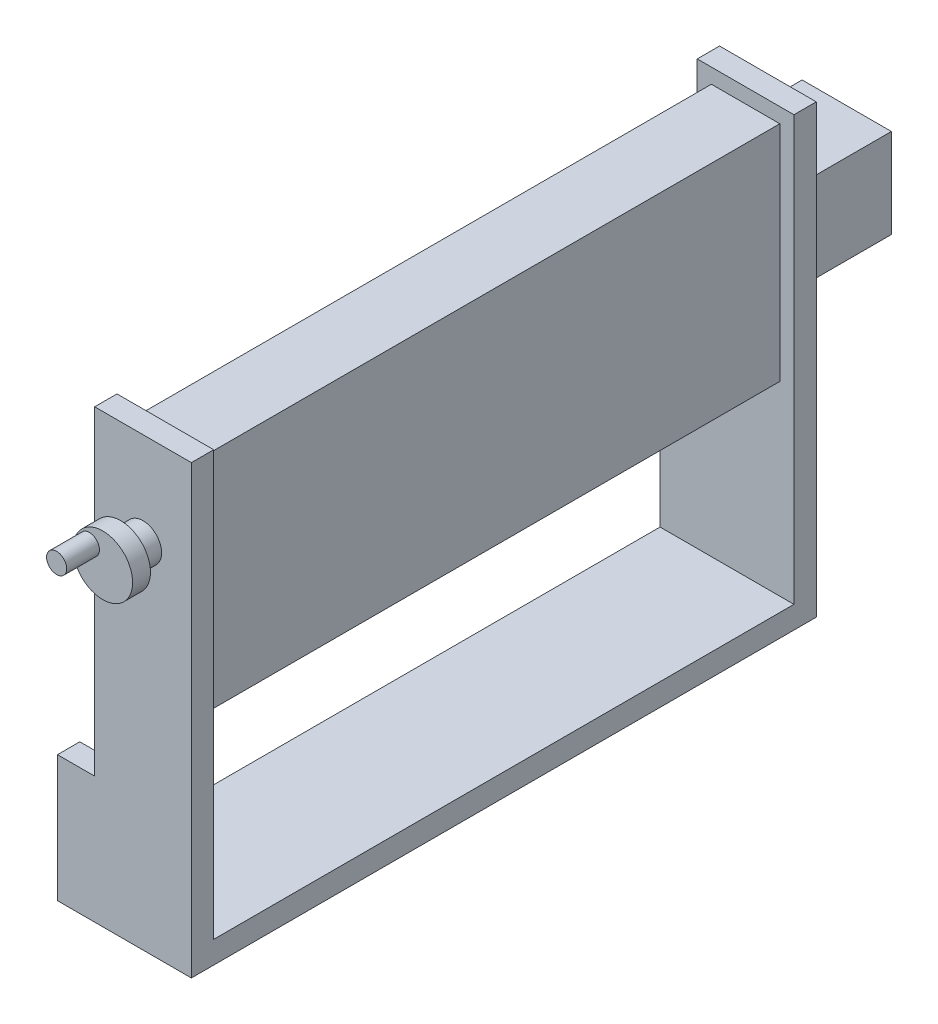
ISO-10303-21;
HEADER;
FILE_DESCRIPTION(('STEP AP214'),'2;1');
FILE_NAME('part.step','',(''),(''),'','','');
FILE_SCHEMA(('AUTOMOTIVE_DESIGN { 1 0 10303 214 1 1 1 1 }'));
ENDSEC;
DATA;
#1=APPLICATION_CONTEXT('core data for automotive mechanical design processes');
#2=APPLICATION_PROTOCOL_DEFINITION('international standard','automotive_design',2000,#1);
#3=PRODUCT_CONTEXT('',#1,'mechanical');
#4=PRODUCT('Part','Part','',(#3));
#5=PRODUCT_RELATED_PRODUCT_CATEGORY('part','',(#4));
#6=PRODUCT_DEFINITION_FORMATION('','',#4);
#7=PRODUCT_DEFINITION_CONTEXT('part definition',#1,'design');
#8=PRODUCT_DEFINITION('design','',#6,#7);
#9=PRODUCT_DEFINITION_SHAPE('','',#8);
#10=(LENGTH_UNIT() NAMED_UNIT(*) SI_UNIT(.MILLI.,.METRE.));
#11=(NAMED_UNIT(*) PLANE_ANGLE_UNIT() SI_UNIT($,.RADIAN.));
#12=(NAMED_UNIT(*) SI_UNIT($,.STERADIAN.) SOLID_ANGLE_UNIT());
#13=UNCERTAINTY_MEASURE_WITH_UNIT(LENGTH_MEASURE(1.E-05),#10,'distance_accuracy_value','');
#14=(GEOMETRIC_REPRESENTATION_CONTEXT(3) GLOBAL_UNCERTAINTY_ASSIGNED_CONTEXT((#13)) GLOBAL_UNIT_ASSIGNED_CONTEXT((#10,
#11,#12)) REPRESENTATION_CONTEXT('',''));
#15=CARTESIAN_POINT('',(0.,0.,0.));
#16=DIRECTION('',(0.,0.,1.));
#17=DIRECTION('',(1.,0.,0.));
#18=AXIS2_PLACEMENT_3D('',#15,#16,#17);
#19=CARTESIAN_POINT('',(0.,0.,0.));
#20=DIRECTION('',(0.,0.,-1.));
#21=DIRECTION('',(-1.,0.,0.));
#22=AXIS2_PLACEMENT_3D('',#19,#20,#21);
#23=PLANE('',#22);
#24=DIRECTION('',(-1.,0.,0.));
#25=VECTOR('',#24,1.);
#26=CARTESIAN_POINT('',(80.5,140.,0.));
#27=LINE('',#26,#25);
#28=CARTESIAN_POINT('',(80.5,140.,0.));
#29=VERTEX_POINT('',#28);
#30=CARTESIAN_POINT('',(34.5,140.,0.));
#31=VERTEX_POINT('',#30);
#32=EDGE_CURVE('E235',#29,#31,#27,.T.);
#33=ORIENTED_EDGE('',*,*,#32,.F.);
#34=DIRECTION('',(0.,-1.,0.));
#35=VECTOR('',#34,1.);
#36=CARTESIAN_POINT('',(80.5,290.,0.));
#37=LINE('',#36,#35);
#38=CARTESIAN_POINT('',(80.5,290.,0.));
#39=VERTEX_POINT('',#38);
#40=EDGE_CURVE('E218',#39,#29,#37,.T.);
#41=ORIENTED_EDGE('',*,*,#40,.F.);
#42=DIRECTION('',(1.,0.,0.));
#43=VECTOR('',#42,1.);
#44=CARTESIAN_POINT('',(80.5,290.,0.));
#45=LINE('',#44,#43);
#46=CARTESIAN_POINT('',(34.5,290.,0.));
#47=VERTEX_POINT('',#46);
#48=EDGE_CURVE('E223',#47,#39,#45,.T.);
#49=ORIENTED_EDGE('',*,*,#48,.F.);
#50=DIRECTION('',(0.,1.,0.));
#51=VECTOR('',#50,1.);
#52=CARTESIAN_POINT('',(34.5,290.,0.));
#53=LINE('',#52,#51);
#54=EDGE_CURVE('E237',#31,#47,#53,.T.);
#55=ORIENTED_EDGE('',*,*,#54,.F.);
#56=EDGE_LOOP('',(#33,#41,#49,#55));
#57=FACE_BOUND('',#56,.T.);
#58=DIRECTION('',(0.,1.,0.));
#59=VECTOR('',#58,1.);
#60=CARTESIAN_POINT('',(90.,0.,0.));
#61=LINE('',#60,#59);
#62=CARTESIAN_POINT('',(90.,15.,0.));
#63=VERTEX_POINT('',#62);
#64=CARTESIAN_POINT('',(90.,300.,0.));
#65=VERTEX_POINT('',#64);
#66=EDGE_CURVE('E277',#63,#65,#61,.T.);
#67=ORIENTED_EDGE('',*,*,#66,.F.);
#68=DIRECTION('',(1.,0.,0.));
#69=VECTOR('',#68,1.);
#70=CARTESIAN_POINT('',(0.,15.,0.));
#71=LINE('',#70,#69);
#72=CARTESIAN_POINT('',(0.,15.,0.));
#73=VERTEX_POINT('',#72);
#74=EDGE_CURVE('E173',#73,#63,#71,.T.);
#75=ORIENTED_EDGE('',*,*,#74,.F.);
#76=DIRECTION('',(0.,-1.,0.));
#77=VECTOR('',#76,1.);
#78=CARTESIAN_POINT('',(0.,0.,0.));
#79=LINE('',#78,#77);
#80=CARTESIAN_POINT('',(0.,85.,0.));
#81=VERTEX_POINT('',#80);
#82=EDGE_CURVE('E259',#81,#73,#79,.T.);
#83=ORIENTED_EDGE('',*,*,#82,.F.);
#84=DIRECTION('',(-1.,0.,0.));
#85=VECTOR('',#84,1.);
#86=CARTESIAN_POINT('',(0.,85.,0.));
#87=LINE('',#86,#85);
#88=CARTESIAN_POINT('',(25.,85.,0.));
#89=VERTEX_POINT('',#88);
#90=EDGE_CURVE('E264',#89,#81,#87,.T.);
#91=ORIENTED_EDGE('',*,*,#90,.F.);
#92=DIRECTION('',(0.,-1.,0.));
#93=VECTOR('',#92,1.);
#94=CARTESIAN_POINT('',(25.,300.,0.));
#95=LINE('',#94,#93);
#96=CARTESIAN_POINT('',(25.,300.,0.));
#97=VERTEX_POINT('',#96);
#98=EDGE_CURVE('E281',#97,#89,#95,.T.);
#99=ORIENTED_EDGE('',*,*,#98,.F.);
#100=DIRECTION('',(-1.,0.,0.));
#101=VECTOR('',#100,1.);
#102=CARTESIAN_POINT('',(25.,300.,0.));
#103=LINE('',#102,#101);
#104=EDGE_CURVE('E279',#65,#97,#103,.T.);
#105=ORIENTED_EDGE('',*,*,#104,.F.);
#106=EDGE_LOOP('',(#67,#75,#83,#91,#99,#105));
#107=FACE_BOUND('',#106,.T.);
#108=ADVANCED_FACE('F37',(#57,#107),#23,.T.);
#109=CARTESIAN_POINT('',(0.,0.,-390.));
#110=DIRECTION('',(0.,0.,-1.));
#111=DIRECTION('',(-1.,0.,0.));
#112=AXIS2_PLACEMENT_3D('',#109,#110,#111);
#113=PLANE('',#112);
#114=DIRECTION('',(1.,0.,0.));
#115=VECTOR('',#114,1.);
#116=CARTESIAN_POINT('',(80.5,290.,-390.));
#117=LINE('',#116,#115);
#118=CARTESIAN_POINT('',(34.5,290.,-390.));
#119=VERTEX_POINT('',#118);
#120=CARTESIAN_POINT('',(80.5,290.,-390.));
#121=VERTEX_POINT('',#120);
#122=EDGE_CURVE('E229',#119,#121,#117,.T.);
#123=ORIENTED_EDGE('',*,*,#122,.T.);
#124=DIRECTION('',(0.,-1.,0.));
#125=VECTOR('',#124,1.);
#126=CARTESIAN_POINT('',(80.5,290.,-390.));
#127=LINE('',#126,#125);
#128=CARTESIAN_POINT('',(80.5,140.,-390.));
#129=VERTEX_POINT('',#128);
#130=EDGE_CURVE('E219',#121,#129,#127,.T.);
#131=ORIENTED_EDGE('',*,*,#130,.T.);
#132=DIRECTION('',(-1.,0.,0.));
#133=VECTOR('',#132,1.);
#134=CARTESIAN_POINT('',(80.5,140.,-390.));
#135=LINE('',#134,#133);
#136=CARTESIAN_POINT('',(34.5,140.,-390.));
#137=VERTEX_POINT('',#136);
#138=EDGE_CURVE('E222',#129,#137,#135,.T.);
#139=ORIENTED_EDGE('',*,*,#138,.T.);
#140=DIRECTION('',(0.,1.,0.));
#141=VECTOR('',#140,1.);
#142=CARTESIAN_POINT('',(34.5,290.,-390.));
#143=LINE('',#142,#141);
#144=EDGE_CURVE('E226',#137,#119,#143,.T.);
#145=ORIENTED_EDGE('',*,*,#144,.T.);
#146=EDGE_LOOP('',(#123,#131,#139,#145));
#147=FACE_BOUND('',#146,.T.);
#148=DIRECTION('',(-1.,0.,0.));
#149=VECTOR('',#148,1.);
#150=CARTESIAN_POINT('',(0.,15.,-390.));
#151=LINE('',#150,#149);
#152=CARTESIAN_POINT('',(90.,15.,-390.));
#153=VERTEX_POINT('',#152);
#154=CARTESIAN_POINT('',(0.,15.,-390.));
#155=VERTEX_POINT('',#154);
#156=EDGE_CURVE('E59',#153,#155,#151,.T.);
#157=ORIENTED_EDGE('',*,*,#156,.F.);
#158=DIRECTION('',(0.,-1.,0.));
#159=VECTOR('',#158,1.);
#160=CARTESIAN_POINT('',(90.,300.,-390.));
#161=LINE('',#160,#159);
#162=CARTESIAN_POINT('',(90.,300.,-390.));
#163=VERTEX_POINT('',#162);
#164=EDGE_CURVE('E182',#163,#153,#161,.T.);
#165=ORIENTED_EDGE('',*,*,#164,.F.);
#166=DIRECTION('',(1.,0.,0.));
#167=VECTOR('',#166,1.);
#168=CARTESIAN_POINT('',(90.,300.,-390.));
#169=LINE('',#168,#167);
#170=CARTESIAN_POINT('',(25.,300.,-390.));
#171=VERTEX_POINT('',#170);
#172=EDGE_CURVE('E205',#171,#163,#169,.T.);
#173=ORIENTED_EDGE('',*,*,#172,.F.);
#174=DIRECTION('',(0.,1.,0.));
#175=VECTOR('',#174,1.);
#176=CARTESIAN_POINT('',(25.,300.,-390.));
#177=LINE('',#176,#175);
#178=CARTESIAN_POINT('',(25.,85.,-390.));
#179=VERTEX_POINT('',#178);
#180=EDGE_CURVE('E203',#179,#171,#177,.T.);
#181=ORIENTED_EDGE('',*,*,#180,.F.);
#182=DIRECTION('',(1.,0.,0.));
#183=VECTOR('',#182,1.);
#184=CARTESIAN_POINT('',(25.,85.,-390.));
#185=LINE('',#184,#183);
#186=CARTESIAN_POINT('',(0.,85.,-390.));
#187=VERTEX_POINT('',#186);
#188=EDGE_CURVE('E194',#187,#179,#185,.T.);
#189=ORIENTED_EDGE('',*,*,#188,.F.);
#190=DIRECTION('',(0.,1.,0.));
#191=VECTOR('',#190,1.);
#192=CARTESIAN_POINT('',(0.,85.,-390.));
#193=LINE('',#192,#191);
#194=EDGE_CURVE('E184',#155,#187,#193,.T.);
#195=ORIENTED_EDGE('',*,*,#194,.F.);
#196=EDGE_LOOP('',(#157,#165,#173,#181,#189,#195));
#197=FACE_BOUND('',#196,.T.);
#198=ADVANCED_FACE('F180',(#147,#197),#113,.F.);
#199=CARTESIAN_POINT('',(0.,0.,-405.));
#200=DIRECTION('',(0.,0.,-1.));
#201=DIRECTION('',(-1.,0.,0.));
#202=AXIS2_PLACEMENT_3D('',#199,#200,#201);
#203=PLANE('',#202);
#204=DIRECTION('',(0.,-1.,0.));
#205=VECTOR('',#204,1.);
#206=CARTESIAN_POINT('',(90.,300.,-405.));
#207=LINE('',#206,#205);
#208=CARTESIAN_POINT('',(90.,300.,-405.));
#209=VERTEX_POINT('',#208);
#210=CARTESIAN_POINT('',(90.,0.,-405.));
#211=VERTEX_POINT('',#210);
#212=EDGE_CURVE('E207',#209,#211,#207,.T.);
#213=ORIENTED_EDGE('',*,*,#212,.T.);
#214=DIRECTION('',(-1.,0.,0.));
#215=VECTOR('',#214,1.);
#216=CARTESIAN_POINT('',(90.,0.,-405.));
#217=LINE('',#216,#215);
#218=CARTESIAN_POINT('',(0.,0.,-405.));
#219=VERTEX_POINT('',#218);
#220=EDGE_CURVE('E302',#211,#219,#217,.T.);
#221=ORIENTED_EDGE('',*,*,#220,.T.);
#222=DIRECTION('',(0.,1.,0.));
#223=VECTOR('',#222,1.);
#224=CARTESIAN_POINT('',(0.,85.,-405.));
#225=LINE('',#224,#223);
#226=CARTESIAN_POINT('',(0.,85.,-405.));
#227=VERTEX_POINT('',#226);
#228=EDGE_CURVE('E310',#219,#227,#225,.T.);
#229=ORIENTED_EDGE('',*,*,#228,.T.);
#230=DIRECTION('',(1.,0.,0.));
#231=VECTOR('',#230,1.);
#232=CARTESIAN_POINT('',(25.,85.,-405.));
#233=LINE('',#232,#231);
#234=CARTESIAN_POINT('',(25.,85.,-405.));
#235=VERTEX_POINT('',#234);
#236=EDGE_CURVE('E314',#227,#235,#233,.T.);
#237=ORIENTED_EDGE('',*,*,#236,.T.);
#238=DIRECTION('',(0.,1.,0.));
#239=VECTOR('',#238,1.);
#240=CARTESIAN_POINT('',(25.,300.,-405.));
#241=LINE('',#240,#239);
#242=CARTESIAN_POINT('',(25.,300.,-405.));
#243=VERTEX_POINT('',#242);
#244=EDGE_CURVE('E316',#235,#243,#241,.T.);
#245=ORIENTED_EDGE('',*,*,#244,.T.);
#246=DIRECTION('',(1.,0.,0.));
#247=VECTOR('',#246,1.);
#248=CARTESIAN_POINT('',(90.,300.,-405.));
#249=LINE('',#248,#247);
#250=EDGE_CURVE('E199',#243,#209,#249,.T.);
#251=ORIENTED_EDGE('',*,*,#250,.T.);
#252=EDGE_LOOP('',(#213,#221,#229,#237,#245,#251));
#253=FACE_BOUND('',#252,.T.);
#254=DIRECTION('',(-1.,0.,0.));
#255=VECTOR('',#254,1.);
#256=CARTESIAN_POINT('',(87.5,195.,-405.));
#257=LINE('',#256,#255);
#258=CARTESIAN_POINT('',(87.5,195.,-405.));
#259=VERTEX_POINT('',#258);
#260=CARTESIAN_POINT('',(27.5,195.,-405.));
#261=VERTEX_POINT('',#260);
#262=EDGE_CURVE('E340',#259,#261,#257,.T.);
#263=ORIENTED_EDGE('',*,*,#262,.F.);
#264=DIRECTION('',(0.,-1.,0.));
#265=VECTOR('',#264,1.);
#266=CARTESIAN_POINT('',(87.5,255.,-405.));
#267=LINE('',#266,#265);
#268=CARTESIAN_POINT('',(87.5,255.,-405.));
#269=VERTEX_POINT('',#268);
#270=EDGE_CURVE('E342',#269,#259,#267,.T.);
#271=ORIENTED_EDGE('',*,*,#270,.F.);
#272=DIRECTION('',(1.,0.,0.));
#273=VECTOR('',#272,1.);
#274=CARTESIAN_POINT('',(87.5,255.,-405.));
#275=LINE('',#274,#273);
#276=CARTESIAN_POINT('',(27.5,255.,-405.));
#277=VERTEX_POINT('',#276);
#278=EDGE_CURVE('E334',#277,#269,#275,.T.);
#279=ORIENTED_EDGE('',*,*,#278,.F.);
#280=DIRECTION('',(0.,1.,0.));
#281=VECTOR('',#280,1.);
#282=CARTESIAN_POINT('',(27.5,255.,-405.));
#283=LINE('',#282,#281);
#284=EDGE_CURVE('E337',#261,#277,#283,.T.);
#285=ORIENTED_EDGE('',*,*,#284,.F.);
#286=EDGE_LOOP('',(#263,#271,#279,#285));
#287=FACE_BOUND('',#286,.T.);
#288=ADVANCED_FACE('F308',(#253,#287),#203,.T.);
#289=CARTESIAN_POINT('',(0.,0.,15.));
#290=DIRECTION('',(1.,0.,0.));
#291=DIRECTION('',(0.,0.,-1.));
#292=AXIS2_PLACEMENT_3D('',#289,#290,#291);
#293=PLANE('',#292);
#294=ORIENTED_EDGE('',*,*,#82,.T.);
#295=DIRECTION('',(0.,0.,-1.));
#296=VECTOR('',#295,1.);
#297=CARTESIAN_POINT('',(0.,15.,42.002));
#298=LINE('',#297,#296);
#299=EDGE_CURVE('E175',#73,#155,#298,.T.);
#300=ORIENTED_EDGE('',*,*,#299,.T.);
#301=ORIENTED_EDGE('',*,*,#194,.T.);
#302=DIRECTION('',(0.,0.,1.));
#303=VECTOR('',#302,1.);
#304=CARTESIAN_POINT('',(0.,85.,-405.));
#305=LINE('',#304,#303);
#306=EDGE_CURVE('E215',#227,#187,#305,.T.);
#307=ORIENTED_EDGE('',*,*,#306,.F.);
#308=ORIENTED_EDGE('',*,*,#228,.F.);
#309=DIRECTION('',(0.,0.,-1.));
#310=VECTOR('',#309,1.);
#311=CARTESIAN_POINT('',(0.,0.,15.));
#312=LINE('',#311,#310);
#313=CARTESIAN_POINT('',(0.,0.,15.));
#314=VERTEX_POINT('',#313);
#315=EDGE_CURVE('E45',#314,#219,#312,.T.);
#316=ORIENTED_EDGE('',*,*,#315,.F.);
#317=DIRECTION('',(0.,-1.,0.));
#318=VECTOR('',#317,1.);
#319=CARTESIAN_POINT('',(0.,0.,15.));
#320=LINE('',#319,#318);
#321=CARTESIAN_POINT('',(0.,85.,15.));
#322=VERTEX_POINT('',#321);
#323=EDGE_CURVE('E260',#322,#314,#320,.T.);
#324=ORIENTED_EDGE('',*,*,#323,.F.);
#325=DIRECTION('',(0.,0.,-1.));
#326=VECTOR('',#325,1.);
#327=CARTESIAN_POINT('',(0.,85.,15.));
#328=LINE('',#327,#326);
#329=EDGE_CURVE('E274',#322,#81,#328,.T.);
#330=ORIENTED_EDGE('',*,*,#329,.T.);
#331=EDGE_LOOP('',(#294,#300,#301,#307,#308,#316,#324,#330));
#332=FACE_BOUND('',#331,.T.);
#333=ADVANCED_FACE('F39',(#332),#293,.F.);
#334=CARTESIAN_POINT('',(0.,0.,15.));
#335=DIRECTION('',(0.,1.,0.));
#336=DIRECTION('',(0.,0.,1.));
#337=AXIS2_PLACEMENT_3D('',#334,#335,#336);
#338=PLANE('',#337);
#339=ORIENTED_EDGE('',*,*,#315,.T.);
#340=ORIENTED_EDGE('',*,*,#220,.F.);
#341=DIRECTION('',(0.,0.,-1.));
#342=VECTOR('',#341,1.);
#343=CARTESIAN_POINT('',(90.,0.,15.));
#344=LINE('',#343,#342);
#345=CARTESIAN_POINT('',(90.,0.,15.));
#346=VERTEX_POINT('',#345);
#347=EDGE_CURVE('E295',#346,#211,#344,.T.);
#348=ORIENTED_EDGE('',*,*,#347,.F.);
#349=DIRECTION('',(1.,0.,0.));
#350=VECTOR('',#349,1.);
#351=CARTESIAN_POINT('',(0.,0.,15.));
#352=LINE('',#351,#350);
#353=EDGE_CURVE('E263',#314,#346,#352,.T.);
#354=ORIENTED_EDGE('',*,*,#353,.F.);
#355=EDGE_LOOP('',(#339,#340,#348,#354));
#356=FACE_BOUND('',#355,.T.);
#357=ADVANCED_FACE('F300',(#356),#338,.F.);
#358=CARTESIAN_POINT('',(90.,0.,15.));
#359=DIRECTION('',(-1.,0.,0.));
#360=DIRECTION('',(0.,0.,1.));
#361=AXIS2_PLACEMENT_3D('',#358,#359,#360);
#362=PLANE('',#361);
#363=ORIENTED_EDGE('',*,*,#347,.T.);
#364=ORIENTED_EDGE('',*,*,#212,.F.);
#365=DIRECTION('',(0.,0.,1.));
#366=VECTOR('',#365,1.);
#367=CARTESIAN_POINT('',(90.,300.,-405.));
#368=LINE('',#367,#366);
#369=EDGE_CURVE('E191',#209,#163,#368,.T.);
#370=ORIENTED_EDGE('',*,*,#369,.T.);
#371=ORIENTED_EDGE('',*,*,#164,.T.);
#372=DIRECTION('',(0.,0.,-1.));
#373=VECTOR('',#372,1.);
#374=CARTESIAN_POINT('',(90.,15.,42.002));
#375=LINE('',#374,#373);
#376=EDGE_CURVE('E52',#63,#153,#375,.T.);
#377=ORIENTED_EDGE('',*,*,#376,.F.);
#378=ORIENTED_EDGE('',*,*,#66,.T.);
#379=DIRECTION('',(0.,0.,-1.));
#380=VECTOR('',#379,1.);
#381=CARTESIAN_POINT('',(90.,300.,15.));
#382=LINE('',#381,#380);
#383=CARTESIAN_POINT('',(90.,300.,15.));
#384=VERTEX_POINT('',#383);
#385=EDGE_CURVE('E292',#384,#65,#382,.T.);
#386=ORIENTED_EDGE('',*,*,#385,.F.);
#387=DIRECTION('',(0.,1.,0.));
#388=VECTOR('',#387,1.);
#389=CARTESIAN_POINT('',(90.,0.,15.));
#390=LINE('',#389,#388);
#391=EDGE_CURVE('E266',#346,#384,#390,.T.);
#392=ORIENTED_EDGE('',*,*,#391,.F.);
#393=EDGE_LOOP('',(#363,#364,#370,#371,#377,#378,#386,#392));
#394=FACE_BOUND('',#393,.T.);
#395=ADVANCED_FACE('F188',(#394),#362,.F.);
#396=CARTESIAN_POINT('',(25.,300.,15.));
#397=DIRECTION('',(0.,-1.,0.));
#398=DIRECTION('',(0.,0.,-1.));
#399=AXIS2_PLACEMENT_3D('',#396,#397,#398);
#400=PLANE('',#399);
#401=ORIENTED_EDGE('',*,*,#104,.T.);
#402=DIRECTION('',(0.,0.,-1.));
#403=VECTOR('',#402,1.);
#404=CARTESIAN_POINT('',(25.,300.,15.));
#405=LINE('',#404,#403);
#406=CARTESIAN_POINT('',(25.,300.,15.));
#407=VERTEX_POINT('',#406);
#408=EDGE_CURVE('E289',#407,#97,#405,.T.);
#409=ORIENTED_EDGE('',*,*,#408,.F.);
#410=DIRECTION('',(-1.,0.,0.));
#411=VECTOR('',#410,1.);
#412=CARTESIAN_POINT('',(25.,300.,15.));
#413=LINE('',#412,#411);
#414=EDGE_CURVE('E268',#384,#407,#413,.T.);
#415=ORIENTED_EDGE('',*,*,#414,.F.);
#416=ORIENTED_EDGE('',*,*,#385,.T.);
#417=EDGE_LOOP('',(#401,#409,#415,#416));
#418=FACE_BOUND('',#417,.T.);
#419=ADVANCED_FACE('F413',(#418),#400,.F.);
#420=CARTESIAN_POINT('',(25.,300.,15.));
#421=DIRECTION('',(1.,0.,0.));
#422=DIRECTION('',(0.,1.,0.));
#423=AXIS2_PLACEMENT_3D('',#420,#421,#422);
#424=PLANE('',#423);
#425=ORIENTED_EDGE('',*,*,#98,.T.);
#426=DIRECTION('',(0.,0.,-1.));
#427=VECTOR('',#426,1.);
#428=CARTESIAN_POINT('',(25.,85.,15.));
#429=LINE('',#428,#427);
#430=CARTESIAN_POINT('',(25.,85.,15.));
#431=VERTEX_POINT('',#430);
#432=EDGE_CURVE('E286',#431,#89,#429,.T.);
#433=ORIENTED_EDGE('',*,*,#432,.F.);
#434=DIRECTION('',(0.,-1.,0.));
#435=VECTOR('',#434,1.);
#436=CARTESIAN_POINT('',(25.,300.,15.));
#437=LINE('',#436,#435);
#438=EDGE_CURVE('E270',#407,#431,#437,.T.);
#439=ORIENTED_EDGE('',*,*,#438,.F.);
#440=ORIENTED_EDGE('',*,*,#408,.T.);
#441=EDGE_LOOP('',(#425,#433,#439,#440));
#442=FACE_BOUND('',#441,.T.);
#443=ADVANCED_FACE('F409',(#442),#424,.F.);
#444=CARTESIAN_POINT('',(0.,85.,15.));
#445=DIRECTION('',(0.,-1.,0.));
#446=DIRECTION('',(0.,0.,-1.));
#447=AXIS2_PLACEMENT_3D('',#444,#445,#446);
#448=PLANE('',#447);
#449=ORIENTED_EDGE('',*,*,#90,.T.);
#450=ORIENTED_EDGE('',*,*,#329,.F.);
#451=DIRECTION('',(-1.,0.,0.));
#452=VECTOR('',#451,1.);
#453=CARTESIAN_POINT('',(0.,85.,15.));
#454=LINE('',#453,#452);
#455=EDGE_CURVE('E272',#431,#322,#454,.T.);
#456=ORIENTED_EDGE('',*,*,#455,.F.);
#457=ORIENTED_EDGE('',*,*,#432,.T.);
#458=EDGE_LOOP('',(#449,#450,#456,#457));
#459=FACE_BOUND('',#458,.T.);
#460=ADVANCED_FACE('F406',(#459),#448,.F.);
#461=CARTESIAN_POINT('',(0.,0.,15.));
#462=DIRECTION('',(0.,0.,-1.));
#463=DIRECTION('',(-1.,0.,0.));
#464=AXIS2_PLACEMENT_3D('',#461,#462,#463);
#465=PLANE('',#464);
#466=CARTESIAN_POINT('',(57.5,237.462606558745,15.));
#467=DIRECTION('',(0.,0.,-1.));
#468=DIRECTION('',(-1.,0.,0.));
#469=AXIS2_PLACEMENT_3D('',#466,#467,#468);
#470=CIRCLE('',#469,12.5);
#471=CARTESIAN_POINT('',(45.,237.462606558745,15.));
#472=VERTEX_POINT('',#471);
#473=EDGE_CURVE('E11',#472,#472,#470,.F.);
#474=ORIENTED_EDGE('',*,*,#473,.F.);
#475=EDGE_LOOP('',(#474));
#476=FACE_BOUND('',#475,.T.);
#477=ORIENTED_EDGE('',*,*,#323,.T.);
#478=ORIENTED_EDGE('',*,*,#353,.T.);
#479=ORIENTED_EDGE('',*,*,#391,.T.);
#480=ORIENTED_EDGE('',*,*,#414,.T.);
#481=ORIENTED_EDGE('',*,*,#438,.T.);
#482=ORIENTED_EDGE('',*,*,#455,.T.);
#483=EDGE_LOOP('',(#477,#478,#479,#480,#481,#482));
#484=FACE_BOUND('',#483,.T.);
#485=ADVANCED_FACE('F404',(#476,#484),#465,.F.);
#486=CARTESIAN_POINT('',(57.5,237.462606558745,30.));
#487=DIRECTION('',(0.,0.,-1.));
#488=DIRECTION('',(-1.,0.,0.));
#489=AXIS2_PLACEMENT_3D('',#486,#487,#488);
#490=CYLINDRICAL_SURFACE('',#489,12.5);
#491=CARTESIAN_POINT('',(57.5,237.462606558745,30.));
#492=DIRECTION('',(0.,0.,1.));
#493=DIRECTION('',(1.,0.,0.));
#494=AXIS2_PLACEMENT_3D('',#491,#492,#493);
#495=CIRCLE('',#494,12.5);
#496=CARTESIAN_POINT('',(70.,237.462606558745,30.));
#497=VERTEX_POINT('',#496);
#498=EDGE_CURVE('E254',#497,#497,#495,.T.);
#499=ORIENTED_EDGE('',*,*,#498,.F.);
#500=EDGE_LOOP('',(#499));
#501=FACE_BOUND('',#500,.T.);
#502=ORIENTED_EDGE('',*,*,#473,.T.);
#503=EDGE_LOOP('',(#502));
#504=FACE_BOUND('',#503,.T.);
#505=ADVANCED_FACE('F378',(#501,#504),#490,.T.);
#506=CARTESIAN_POINT('',(57.5,237.462606558745,42.));
#507=DIRECTION('',(0.,0.,-1.));
#508=DIRECTION('',(-1.,0.,0.));
#509=AXIS2_PLACEMENT_3D('',#506,#507,#508);
#510=CYLINDRICAL_SURFACE('',#509,20.);
#511=CARTESIAN_POINT('',(57.5,237.462606558745,42.));
#512=DIRECTION('',(0.,0.,1.));
#513=DIRECTION('',(1.,0.,0.));
#514=AXIS2_PLACEMENT_3D('',#511,#512,#513);
#515=CIRCLE('',#514,20.);
#516=CARTESIAN_POINT('',(77.5,237.462606558745,42.));
#517=VERTEX_POINT('',#516);
#518=EDGE_CURVE('E251',#517,#517,#515,.T.);
#519=ORIENTED_EDGE('',*,*,#518,.F.);
#520=EDGE_LOOP('',(#519));
#521=FACE_BOUND('',#520,.T.);
#522=CARTESIAN_POINT('',(57.5,237.462606558745,30.));
#523=DIRECTION('',(0.,0.,1.));
#524=DIRECTION('',(1.,0.,0.));
#525=AXIS2_PLACEMENT_3D('',#522,#523,#524);
#526=CIRCLE('',#525,20.);
#527=CARTESIAN_POINT('',(77.5,237.462606558745,30.));
#528=VERTEX_POINT('',#527);
#529=EDGE_CURVE('E250',#528,#528,#526,.T.);
#530=ORIENTED_EDGE('',*,*,#529,.T.);
#531=EDGE_LOOP('',(#530));
#532=FACE_BOUND('',#531,.T.);
#533=ADVANCED_FACE('F372',(#521,#532),#510,.T.);
#534=CARTESIAN_POINT('',(57.5,237.462606558745,42.));
#535=DIRECTION('',(0.,0.,1.));
#536=DIRECTION('',(1.,0.,0.));
#537=AXIS2_PLACEMENT_3D('',#534,#535,#536);
#538=PLANE('',#537);
#539=CARTESIAN_POINT('',(48.4434927047701,245.308936778858,42.));
#540=DIRECTION('',(0.,0.,1.));
#541=DIRECTION('',(1.,0.,0.));
#542=AXIS2_PLACEMENT_3D('',#539,#540,#541);
#543=CIRCLE('',#542,6.75806604980692);
#544=CARTESIAN_POINT('',(55.201558754577,245.308936778858,42.));
#545=VERTEX_POINT('',#544);
#546=EDGE_CURVE('E354',#545,#545,#543,.T.);
#547=ORIENTED_EDGE('',*,*,#546,.F.);
#548=EDGE_LOOP('',(#547));
#549=FACE_BOUND('',#548,.T.);
#550=ORIENTED_EDGE('',*,*,#518,.T.);
#551=EDGE_LOOP('',(#550));
#552=FACE_BOUND('',#551,.T.);
#553=ADVANCED_FACE('F368',(#549,#552),#538,.T.);
#554=CARTESIAN_POINT('',(57.5,237.462606558745,30.));
#555=DIRECTION('',(0.,0.,1.));
#556=DIRECTION('',(1.,0.,0.));
#557=AXIS2_PLACEMENT_3D('',#554,#555,#556);
#558=PLANE('',#557);
#559=ORIENTED_EDGE('',*,*,#498,.T.);
#560=EDGE_LOOP('',(#559));
#561=FACE_BOUND('',#560,.T.);
#562=ORIENTED_EDGE('',*,*,#529,.F.);
#563=EDGE_LOOP('',(#562));
#564=FACE_BOUND('',#563,.T.);
#565=ADVANCED_FACE('F371',(#561,#564),#558,.F.);
#566=CARTESIAN_POINT('',(80.5,290.,-390.));
#567=DIRECTION('',(-1.,0.,0.));
#568=DIRECTION('',(0.,-1.,0.));
#569=AXIS2_PLACEMENT_3D('',#566,#567,#568);
#570=PLANE('',#569);
#571=ORIENTED_EDGE('',*,*,#40,.T.);
#572=DIRECTION('',(0.,0.,1.));
#573=VECTOR('',#572,1.);
#574=CARTESIAN_POINT('',(80.5,140.,-390.));
#575=LINE('',#574,#573);
#576=EDGE_CURVE('E248',#129,#29,#575,.T.);
#577=ORIENTED_EDGE('',*,*,#576,.F.);
#578=ORIENTED_EDGE('',*,*,#130,.F.);
#579=DIRECTION('',(0.,0.,1.));
#580=VECTOR('',#579,1.);
#581=CARTESIAN_POINT('',(80.5,290.,-390.));
#582=LINE('',#581,#580);
#583=EDGE_CURVE('E232',#121,#39,#582,.T.);
#584=ORIENTED_EDGE('',*,*,#583,.T.);
#585=EDGE_LOOP('',(#571,#577,#578,#584));
#586=FACE_BOUND('',#585,.T.);
#587=ADVANCED_FACE('F383',(#586),#570,.F.);
#588=CARTESIAN_POINT('',(80.5,140.,-390.));
#589=DIRECTION('',(0.,1.,0.));
#590=DIRECTION('',(0.,0.,1.));
#591=AXIS2_PLACEMENT_3D('',#588,#589,#590);
#592=PLANE('',#591);
#593=ORIENTED_EDGE('',*,*,#32,.T.);
#594=DIRECTION('',(0.,0.,1.));
#595=VECTOR('',#594,1.);
#596=CARTESIAN_POINT('',(34.5,140.,-390.));
#597=LINE('',#596,#595);
#598=EDGE_CURVE('E245',#137,#31,#597,.T.);
#599=ORIENTED_EDGE('',*,*,#598,.F.);
#600=ORIENTED_EDGE('',*,*,#138,.F.);
#601=ORIENTED_EDGE('',*,*,#576,.T.);
#602=EDGE_LOOP('',(#593,#599,#600,#601));
#603=FACE_BOUND('',#602,.T.);
#604=ADVANCED_FACE('F389',(#603),#592,.F.);
#605=CARTESIAN_POINT('',(34.5,290.,-390.));
#606=DIRECTION('',(1.,0.,0.));
#607=DIRECTION('',(0.,1.,0.));
#608=AXIS2_PLACEMENT_3D('',#605,#606,#607);
#609=PLANE('',#608);
#610=ORIENTED_EDGE('',*,*,#54,.T.);
#611=DIRECTION('',(0.,0.,1.));
#612=VECTOR('',#611,1.);
#613=CARTESIAN_POINT('',(34.5,290.,-390.));
#614=LINE('',#613,#612);
#615=EDGE_CURVE('E243',#119,#47,#614,.T.);
#616=ORIENTED_EDGE('',*,*,#615,.F.);
#617=ORIENTED_EDGE('',*,*,#144,.F.);
#618=ORIENTED_EDGE('',*,*,#598,.T.);
#619=EDGE_LOOP('',(#610,#616,#617,#618));
#620=FACE_BOUND('',#619,.T.);
#621=ADVANCED_FACE('F446',(#620),#609,.F.);
#622=CARTESIAN_POINT('',(80.5,290.,-390.));
#623=DIRECTION('',(0.,-1.,0.));
#624=DIRECTION('',(0.,0.,-1.));
#625=AXIS2_PLACEMENT_3D('',#622,#623,#624);
#626=PLANE('',#625);
#627=ORIENTED_EDGE('',*,*,#48,.T.);
#628=ORIENTED_EDGE('',*,*,#583,.F.);
#629=ORIENTED_EDGE('',*,*,#122,.F.);
#630=ORIENTED_EDGE('',*,*,#615,.T.);
#631=EDGE_LOOP('',(#627,#628,#629,#630));
#632=FACE_BOUND('',#631,.T.);
#633=ADVANCED_FACE('F442',(#632),#626,.F.);
#634=CARTESIAN_POINT('',(25.,85.,-405.));
#635=DIRECTION('',(0.,-1.,0.));
#636=DIRECTION('',(0.,0.,-1.));
#637=AXIS2_PLACEMENT_3D('',#634,#635,#636);
#638=PLANE('',#637);
#639=ORIENTED_EDGE('',*,*,#188,.T.);
#640=DIRECTION('',(0.,0.,1.));
#641=VECTOR('',#640,1.);
#642=CARTESIAN_POINT('',(25.,85.,-405.));
#643=LINE('',#642,#641);
#644=EDGE_CURVE('E212',#235,#179,#643,.T.);
#645=ORIENTED_EDGE('',*,*,#644,.F.);
#646=ORIENTED_EDGE('',*,*,#236,.F.);
#647=ORIENTED_EDGE('',*,*,#306,.T.);
#648=EDGE_LOOP('',(#639,#645,#646,#647));
#649=FACE_BOUND('',#648,.T.);
#650=ADVANCED_FACE('F438',(#649),#638,.F.);
#651=CARTESIAN_POINT('',(25.,300.,-405.));
#652=DIRECTION('',(1.,0.,0.));
#653=DIRECTION('',(0.,1.,0.));
#654=AXIS2_PLACEMENT_3D('',#651,#652,#653);
#655=PLANE('',#654);
#656=ORIENTED_EDGE('',*,*,#180,.T.);
#657=DIRECTION('',(0.,0.,1.));
#658=VECTOR('',#657,1.);
#659=CARTESIAN_POINT('',(25.,300.,-405.));
#660=LINE('',#659,#658);
#661=EDGE_CURVE('E209',#243,#171,#660,.T.);
#662=ORIENTED_EDGE('',*,*,#661,.F.);
#663=ORIENTED_EDGE('',*,*,#244,.F.);
#664=ORIENTED_EDGE('',*,*,#644,.T.);
#665=EDGE_LOOP('',(#656,#662,#663,#664));
#666=FACE_BOUND('',#665,.T.);
#667=ADVANCED_FACE('F435',(#666),#655,.F.);
#668=CARTESIAN_POINT('',(90.,300.,-405.));
#669=DIRECTION('',(0.,-1.,0.));
#670=DIRECTION('',(0.,0.,-1.));
#671=AXIS2_PLACEMENT_3D('',#668,#669,#670);
#672=PLANE('',#671);
#673=ORIENTED_EDGE('',*,*,#172,.T.);
#674=ORIENTED_EDGE('',*,*,#369,.F.);
#675=ORIENTED_EDGE('',*,*,#250,.F.);
#676=ORIENTED_EDGE('',*,*,#661,.T.);
#677=EDGE_LOOP('',(#673,#674,#675,#676));
#678=FACE_BOUND('',#677,.T.);
#679=ADVANCED_FACE('F323',(#678),#672,.F.);
#680=CARTESIAN_POINT('',(87.5,255.,-458.));
#681=DIRECTION('',(-1.,0.,0.));
#682=DIRECTION('',(0.,-1.,0.));
#683=AXIS2_PLACEMENT_3D('',#680,#681,#682);
#684=PLANE('',#683);
#685=ORIENTED_EDGE('',*,*,#270,.T.);
#686=DIRECTION('',(0.,0.,1.));
#687=VECTOR('',#686,1.);
#688=CARTESIAN_POINT('',(87.5,195.,-458.));
#689=LINE('',#688,#687);
#690=CARTESIAN_POINT('',(87.5,195.,-458.));
#691=VERTEX_POINT('',#690);
#692=EDGE_CURVE('E192',#691,#259,#689,.T.);
#693=ORIENTED_EDGE('',*,*,#692,.F.);
#694=DIRECTION('',(0.,-1.,0.));
#695=VECTOR('',#694,1.);
#696=CARTESIAN_POINT('',(87.5,255.,-458.));
#697=LINE('',#696,#695);
#698=CARTESIAN_POINT('',(87.5,255.,-458.));
#699=VERTEX_POINT('',#698);
#700=EDGE_CURVE('E336',#699,#691,#697,.T.);
#701=ORIENTED_EDGE('',*,*,#700,.F.);
#702=DIRECTION('',(0.,0.,1.));
#703=VECTOR('',#702,1.);
#704=CARTESIAN_POINT('',(87.5,255.,-458.));
#705=LINE('',#704,#703);
#706=EDGE_CURVE('E330',#699,#269,#705,.T.);
#707=ORIENTED_EDGE('',*,*,#706,.T.);
#708=EDGE_LOOP('',(#685,#693,#701,#707));
#709=FACE_BOUND('',#708,.T.);
#710=ADVANCED_FACE('F430',(#709),#684,.F.);
#711=CARTESIAN_POINT('',(87.5,195.,-458.));
#712=DIRECTION('',(0.,1.,0.));
#713=DIRECTION('',(0.,0.,1.));
#714=AXIS2_PLACEMENT_3D('',#711,#712,#713);
#715=PLANE('',#714);
#716=ORIENTED_EDGE('',*,*,#262,.T.);
#717=DIRECTION('',(0.,0.,1.));
#718=VECTOR('',#717,1.);
#719=CARTESIAN_POINT('',(27.5,195.,-458.));
#720=LINE('',#719,#718);
#721=CARTESIAN_POINT('',(27.5,195.,-458.));
#722=VERTEX_POINT('',#721);
#723=EDGE_CURVE('E196',#722,#261,#720,.T.);
#724=ORIENTED_EDGE('',*,*,#723,.F.);
#725=DIRECTION('',(-1.,0.,0.));
#726=VECTOR('',#725,1.);
#727=CARTESIAN_POINT('',(87.5,195.,-458.));
#728=LINE('',#727,#726);
#729=EDGE_CURVE('E348',#691,#722,#728,.T.);
#730=ORIENTED_EDGE('',*,*,#729,.F.);
#731=ORIENTED_EDGE('',*,*,#692,.T.);
#732=EDGE_LOOP('',(#716,#724,#730,#731));
#733=FACE_BOUND('',#732,.T.);
#734=ADVANCED_FACE('F490',(#733),#715,.F.);
#735=CARTESIAN_POINT('',(27.5,255.,-458.));
#736=DIRECTION('',(1.,0.,0.));
#737=DIRECTION('',(0.,0.,-1.));
#738=AXIS2_PLACEMENT_3D('',#735,#736,#737);
#739=PLANE('',#738);
#740=ORIENTED_EDGE('',*,*,#284,.T.);
#741=DIRECTION('',(0.,0.,1.));
#742=VECTOR('',#741,1.);
#743=CARTESIAN_POINT('',(27.5,255.,-458.));
#744=LINE('',#743,#742);
#745=CARTESIAN_POINT('',(27.5,255.,-458.));
#746=VERTEX_POINT('',#745);
#747=EDGE_CURVE('E328',#746,#277,#744,.T.);
#748=ORIENTED_EDGE('',*,*,#747,.F.);
#749=DIRECTION('',(0.,1.,0.));
#750=VECTOR('',#749,1.);
#751=CARTESIAN_POINT('',(27.5,255.,-458.));
#752=LINE('',#751,#750);
#753=EDGE_CURVE('E346',#722,#746,#752,.T.);
#754=ORIENTED_EDGE('',*,*,#753,.F.);
#755=ORIENTED_EDGE('',*,*,#723,.T.);
#756=EDGE_LOOP('',(#740,#748,#754,#755));
#757=FACE_BOUND('',#756,.T.);
#758=ADVANCED_FACE('F497',(#757),#739,.F.);
#759=CARTESIAN_POINT('',(87.5,255.,-458.));
#760=DIRECTION('',(0.,-1.,0.));
#761=DIRECTION('',(0.,0.,-1.));
#762=AXIS2_PLACEMENT_3D('',#759,#760,#761);
#763=PLANE('',#762);
#764=ORIENTED_EDGE('',*,*,#278,.T.);
#765=ORIENTED_EDGE('',*,*,#706,.F.);
#766=DIRECTION('',(1.,0.,0.));
#767=VECTOR('',#766,1.);
#768=CARTESIAN_POINT('',(87.5,255.,-458.));
#769=LINE('',#768,#767);
#770=EDGE_CURVE('E333',#746,#699,#769,.T.);
#771=ORIENTED_EDGE('',*,*,#770,.F.);
#772=ORIENTED_EDGE('',*,*,#747,.T.);
#773=EDGE_LOOP('',(#764,#765,#771,#772));
#774=FACE_BOUND('',#773,.T.);
#775=ADVANCED_FACE('F504',(#774),#763,.F.);
#776=CARTESIAN_POINT('',(0.,0.,-458.));
#777=DIRECTION('',(0.,0.,-1.));
#778=DIRECTION('',(-1.,0.,0.));
#779=AXIS2_PLACEMENT_3D('',#776,#777,#778);
#780=PLANE('',#779);
#781=ORIENTED_EDGE('',*,*,#700,.T.);
#782=ORIENTED_EDGE('',*,*,#729,.T.);
#783=ORIENTED_EDGE('',*,*,#753,.T.);
#784=ORIENTED_EDGE('',*,*,#770,.T.);
#785=EDGE_LOOP('',(#781,#782,#783,#784));
#786=FACE_BOUND('',#785,.T.);
#787=ADVANCED_FACE('F512',(#786),#780,.T.);
#788=CARTESIAN_POINT('',(0.,15.,42.002));
#789=DIRECTION('',(0.,-1.,0.));
#790=DIRECTION('',(0.,0.,-1.));
#791=AXIS2_PLACEMENT_3D('',#788,#789,#790);
#792=PLANE('',#791);
#793=ORIENTED_EDGE('',*,*,#299,.F.);
#794=ORIENTED_EDGE('',*,*,#74,.T.);
#795=ORIENTED_EDGE('',*,*,#376,.T.);
#796=ORIENTED_EDGE('',*,*,#156,.T.);
#797=EDGE_LOOP('',(#793,#794,#795,#796));
#798=FACE_BOUND('',#797,.T.);
#799=ADVANCED_FACE('F171',(#798),#792,.F.);
#800=CARTESIAN_POINT('',(48.4434927047701,245.308936778858,64.));
#801=DIRECTION('',(0.,0.,-1.));
#802=DIRECTION('',(-1.,0.,0.));
#803=AXIS2_PLACEMENT_3D('',#800,#801,#802);
#804=CYLINDRICAL_SURFACE('',#803,6.75806604980692);
#805=CARTESIAN_POINT('',(48.4434927047701,245.308936778858,64.));
#806=DIRECTION('',(0.,0.,1.));
#807=DIRECTION('',(1.,0.,0.));
#808=AXIS2_PLACEMENT_3D('',#805,#806,#807);
#809=CIRCLE('',#808,6.75806604980692);
#810=CARTESIAN_POINT('',(55.201558754577,245.308936778858,64.));
#811=VERTEX_POINT('',#810);
#812=EDGE_CURVE('E185',#811,#811,#809,.T.);
#813=ORIENTED_EDGE('',*,*,#812,.F.);
#814=EDGE_LOOP('',(#813));
#815=FACE_BOUND('',#814,.T.);
#816=ORIENTED_EDGE('',*,*,#546,.T.);
#817=EDGE_LOOP('',(#816));
#818=FACE_BOUND('',#817,.T.);
#819=ADVANCED_FACE('F362',(#815,#818),#804,.T.);
#820=CARTESIAN_POINT('',(48.4434927047701,245.308936778858,64.));
#821=DIRECTION('',(0.,0.,1.));
#822=DIRECTION('',(1.,0.,0.));
#823=AXIS2_PLACEMENT_3D('',#820,#821,#822);
#824=PLANE('',#823);
#825=ORIENTED_EDGE('',*,*,#812,.T.);
#826=EDGE_LOOP('',(#825));
#827=FACE_BOUND('',#826,.T.);
#828=ADVANCED_FACE('F360',(#827),#824,.T.);
#829=CLOSED_SHELL('',(#108,#198,#288,#333,#357,#395,#419,#443,#460,#485,#505,#533,#553,#565,
#587,#604,#621,#633,#650,#667,#679,#710,#734,#758,#775,#787,#799,#819,#828));
#830=MANIFOLD_SOLID_BREP('B2',#829);
#831=ADVANCED_BREP_SHAPE_REPRESENTATION('',(#18,#830),#14);
#832=SHAPE_DEFINITION_REPRESENTATION(#9,#831);
ENDSEC;
END-ISO-10303-21;
